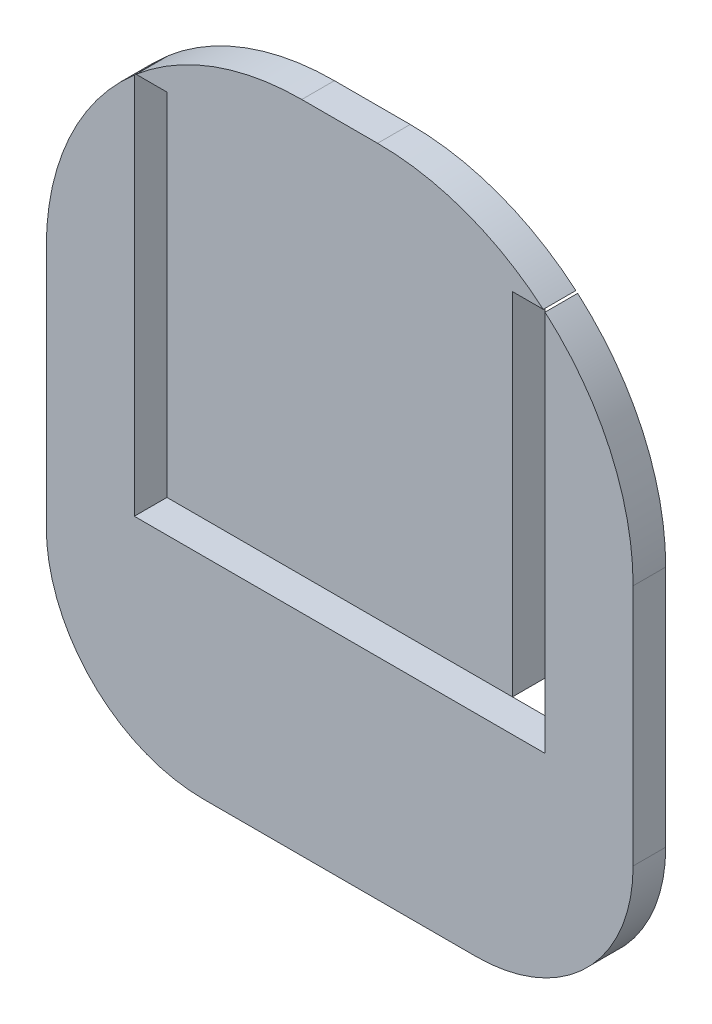
ISO-10303-21;
HEADER;
FILE_DESCRIPTION(('STEP AP214'),'2;1');
FILE_NAME('part.step','',(''),(''),'','','');
FILE_SCHEMA(('AUTOMOTIVE_DESIGN { 1 0 10303 214 1 1 1 1 }'));
ENDSEC;
DATA;
#1=APPLICATION_CONTEXT('core data for automotive mechanical design processes');
#2=APPLICATION_PROTOCOL_DEFINITION('international standard','automotive_design',2000,#1);
#3=PRODUCT_CONTEXT('',#1,'mechanical');
#4=PRODUCT('Part','Part','',(#3));
#5=PRODUCT_RELATED_PRODUCT_CATEGORY('part','',(#4));
#6=PRODUCT_DEFINITION_FORMATION('','',#4);
#7=PRODUCT_DEFINITION_CONTEXT('part definition',#1,'design');
#8=PRODUCT_DEFINITION('design','',#6,#7);
#9=PRODUCT_DEFINITION_SHAPE('','',#8);
#10=(LENGTH_UNIT() NAMED_UNIT(*) SI_UNIT(.MILLI.,.METRE.));
#11=(NAMED_UNIT(*) PLANE_ANGLE_UNIT() SI_UNIT($,.RADIAN.));
#12=(NAMED_UNIT(*) SI_UNIT($,.STERADIAN.) SOLID_ANGLE_UNIT());
#13=UNCERTAINTY_MEASURE_WITH_UNIT(LENGTH_MEASURE(1.E-05),#10,'distance_accuracy_value','');
#14=(GEOMETRIC_REPRESENTATION_CONTEXT(3) GLOBAL_UNCERTAINTY_ASSIGNED_CONTEXT((#13)) GLOBAL_UNIT_ASSIGNED_CONTEXT((#10,
#11,#12)) REPRESENTATION_CONTEXT('',''));
#15=CARTESIAN_POINT('',(0.,0.,0.));
#16=DIRECTION('',(0.,0.,1.));
#17=DIRECTION('',(1.,0.,0.));
#18=AXIS2_PLACEMENT_3D('',#15,#16,#17);
#19=CARTESIAN_POINT('',(5.,-29.5,4.3));
#20=DIRECTION('',(0.,0.,-1.));
#21=DIRECTION('',(-1.,0.,0.));
#22=AXIS2_PLACEMENT_3D('',#19,#20,#21);
#23=CYLINDRICAL_SURFACE('',#22,33.7);
#24=CARTESIAN_POINT('',(5.,-29.5,4.3));
#25=DIRECTION('',(0.,0.,1.));
#26=DIRECTION('',(-1.,0.,0.));
#27=AXIS2_PLACEMENT_3D('',#24,#25,#26);
#28=CIRCLE('',#27,33.7);
#29=CARTESIAN_POINT('',(26.85235312187,-3.84527990725494,4.3));
#30=VERTEX_POINT('',#29);
#31=CARTESIAN_POINT('',(5.,4.2,4.3));
#32=VERTEX_POINT('',#31);
#33=EDGE_CURVE('E142',#30,#32,#28,.T.);
#34=ORIENTED_EDGE('',*,*,#33,.F.);
#35=DIRECTION('',(0.,0.,-1.));
#36=VECTOR('',#35,1.);
#37=CARTESIAN_POINT('',(26.85235312187,-3.84527990725494,4.3));
#38=LINE('',#37,#36);
#39=CARTESIAN_POINT('',(26.85235312187,-3.84527990725494,0.));
#40=VERTEX_POINT('',#39);
#41=EDGE_CURVE('E65',#30,#40,#38,.T.);
#42=ORIENTED_EDGE('',*,*,#41,.T.);
#43=CARTESIAN_POINT('',(5.,-29.5,0.));
#44=DIRECTION('',(0.,0.,1.));
#45=DIRECTION('',(-1.,0.,0.));
#46=AXIS2_PLACEMENT_3D('',#43,#44,#45);
#47=CIRCLE('',#46,33.7);
#48=CARTESIAN_POINT('',(5.,4.2,0.));
#49=VERTEX_POINT('',#48);
#50=EDGE_CURVE('E51',#40,#49,#47,.T.);
#51=ORIENTED_EDGE('',*,*,#50,.T.);
#52=DIRECTION('',(0.,0.,-1.));
#53=VECTOR('',#52,1.);
#54=CARTESIAN_POINT('',(5.,4.2,4.3));
#55=LINE('',#54,#53);
#56=EDGE_CURVE('E146',#32,#49,#55,.T.);
#57=ORIENTED_EDGE('',*,*,#56,.F.);
#58=EDGE_LOOP('',(#34,#42,#51,#57));
#59=FACE_BOUND('',#58,.T.);
#60=ADVANCED_FACE('F48',(#59),#23,.T.);
#61=CARTESIAN_POINT('',(-18.,-61.5,4.3));
#62=DIRECTION('',(0.,0.,1.));
#63=DIRECTION('',(1.,0.,0.));
#64=AXIS2_PLACEMENT_3D('',#61,#62,#63);
#65=PLANE('',#64);
#66=DIRECTION('',(-1.,0.,0.));
#67=VECTOR('',#66,1.);
#68=CARTESIAN_POINT('',(-27.085,-3.84527990725494,4.3));
#69=LINE('',#68,#67);
#70=CARTESIAN_POINT('',(-22.785,-3.84527990725494,4.3));
#71=VERTEX_POINT('',#70);
#72=CARTESIAN_POINT('',(-26.85235312187,-3.84527990725494,4.3));
#73=VERTEX_POINT('',#72);
#74=EDGE_CURVE('E174',#71,#73,#69,.T.);
#75=ORIENTED_EDGE('',*,*,#74,.F.);
#76=DIRECTION('',(0.,1.,0.));
#77=VECTOR('',#76,1.);
#78=CARTESIAN_POINT('',(-22.785,-3.84527990725494,4.3));
#79=LINE('',#78,#77);
#80=CARTESIAN_POINT('',(-22.785,-50.1452799072549,4.3));
#81=VERTEX_POINT('',#80);
#82=EDGE_CURVE('E171',#81,#71,#79,.T.);
#83=ORIENTED_EDGE('',*,*,#82,.F.);
#84=DIRECTION('',(-1.,0.,0.));
#85=VECTOR('',#84,1.);
#86=CARTESIAN_POINT('',(-22.785,-50.1452799072549,4.3));
#87=LINE('',#86,#85);
#88=CARTESIAN_POINT('',(22.785,-50.1452799072549,4.3));
#89=VERTEX_POINT('',#88);
#90=EDGE_CURVE('E126',#89,#81,#87,.T.);
#91=ORIENTED_EDGE('',*,*,#90,.F.);
#92=DIRECTION('',(0.,-1.,0.));
#93=VECTOR('',#92,1.);
#94=CARTESIAN_POINT('',(22.785,-50.1452799072549,4.3));
#95=LINE('',#94,#93);
#96=CARTESIAN_POINT('',(22.785,-3.84527990725494,4.3));
#97=VERTEX_POINT('',#96);
#98=EDGE_CURVE('E57',#97,#89,#95,.T.);
#99=ORIENTED_EDGE('',*,*,#98,.F.);
#100=DIRECTION('',(-1.,0.,0.));
#101=VECTOR('',#100,1.);
#102=CARTESIAN_POINT('',(22.785,-3.84527990725494,4.3));
#103=LINE('',#102,#101);
#104=EDGE_CURVE('E12',#30,#97,#103,.T.);
#105=ORIENTED_EDGE('',*,*,#104,.F.);
#106=ORIENTED_EDGE('',*,*,#33,.T.);
#107=DIRECTION('',(-1.,0.,0.));
#108=VECTOR('',#107,1.);
#109=CARTESIAN_POINT('',(-4.99999999999999,4.2,4.3));
#110=LINE('',#109,#108);
#111=CARTESIAN_POINT('',(-4.99999999999999,4.2,4.3));
#112=VERTEX_POINT('',#111);
#113=EDGE_CURVE('E141',#32,#112,#110,.T.);
#114=ORIENTED_EDGE('',*,*,#113,.T.);
#115=CARTESIAN_POINT('',(-4.99999999999999,-29.5,4.3));
#116=DIRECTION('',(0.,0.,1.));
#117=DIRECTION('',(-1.,0.,0.));
#118=AXIS2_PLACEMENT_3D('',#115,#116,#117);
#119=CIRCLE('',#118,33.7);
#120=EDGE_CURVE('E138',#112,#73,#119,.T.);
#121=ORIENTED_EDGE('',*,*,#120,.T.);
#122=EDGE_LOOP('',(#75,#83,#91,#99,#105,#106,#114,#121));
#123=FACE_BOUND('',#122,.T.);
#124=ADVANCED_FACE('F132',(#123),#65,.T.);
#125=CARTESIAN_POINT('',(-18.,-61.5,0.));
#126=DIRECTION('',(0.,0.,1.));
#127=DIRECTION('',(1.,0.,0.));
#128=AXIS2_PLACEMENT_3D('',#125,#126,#127);
#129=PLANE('',#128);
#130=DIRECTION('',(0.,1.,0.));
#131=VECTOR('',#130,1.);
#132=CARTESIAN_POINT('',(-22.785,-61.5,0.));
#133=LINE('',#132,#131);
#134=CARTESIAN_POINT('',(-22.785,-50.1452799072549,0.));
#135=VERTEX_POINT('',#134);
#136=CARTESIAN_POINT('',(-22.785,-3.84527990725494,0.));
#137=VERTEX_POINT('',#136);
#138=EDGE_CURVE('E94',#135,#137,#133,.T.);
#139=ORIENTED_EDGE('',*,*,#138,.T.);
#140=DIRECTION('',(-1.,0.,0.));
#141=VECTOR('',#140,1.);
#142=CARTESIAN_POINT('',(-18.,-3.84527990725494,0.));
#143=LINE('',#142,#141);
#144=CARTESIAN_POINT('',(-26.85235312187,-3.84527990725494,0.));
#145=VERTEX_POINT('',#144);
#146=EDGE_CURVE('E187',#137,#145,#143,.T.);
#147=ORIENTED_EDGE('',*,*,#146,.T.);
#148=CARTESIAN_POINT('',(-4.99999999999999,-29.5,0.));
#149=DIRECTION('',(0.,0.,1.));
#150=DIRECTION('',(-1.,0.,0.));
#151=AXIS2_PLACEMENT_3D('',#148,#149,#150);
#152=CIRCLE('',#151,33.7);
#153=CARTESIAN_POINT('',(-4.99999999999999,4.2,0.));
#154=VERTEX_POINT('',#153);
#155=EDGE_CURVE('E143',#154,#145,#152,.T.);
#156=ORIENTED_EDGE('',*,*,#155,.F.);
#157=DIRECTION('',(-1.,0.,0.));
#158=VECTOR('',#157,1.);
#159=CARTESIAN_POINT('',(-4.99999999999999,4.2,0.));
#160=LINE('',#159,#158);
#161=EDGE_CURVE('E154',#49,#154,#160,.T.);
#162=ORIENTED_EDGE('',*,*,#161,.F.);
#163=ORIENTED_EDGE('',*,*,#50,.F.);
#164=DIRECTION('',(-1.,0.,0.));
#165=VECTOR('',#164,1.);
#166=CARTESIAN_POINT('',(-18.,-3.84527990725494,0.));
#167=LINE('',#166,#165);
#168=CARTESIAN_POINT('',(22.785,-3.84527990725494,0.));
#169=VERTEX_POINT('',#168);
#170=EDGE_CURVE('E164',#40,#169,#167,.T.);
#171=ORIENTED_EDGE('',*,*,#170,.T.);
#172=DIRECTION('',(0.,-1.,0.));
#173=VECTOR('',#172,1.);
#174=CARTESIAN_POINT('',(22.785,-61.5,0.));
#175=LINE('',#174,#173);
#176=CARTESIAN_POINT('',(22.785,-50.1452799072549,0.));
#177=VERTEX_POINT('',#176);
#178=EDGE_CURVE('E124',#169,#177,#175,.T.);
#179=ORIENTED_EDGE('',*,*,#178,.T.);
#180=DIRECTION('',(-1.,0.,0.));
#181=VECTOR('',#180,1.);
#182=CARTESIAN_POINT('',(-18.,-50.1452799072549,0.));
#183=LINE('',#182,#181);
#184=EDGE_CURVE('E160',#177,#135,#183,.T.);
#185=ORIENTED_EDGE('',*,*,#184,.T.);
#186=EDGE_LOOP('',(#139,#147,#156,#162,#163,#171,#179,#185));
#187=FACE_BOUND('',#186,.T.);
#188=ADVANCED_FACE('F185',(#187),#129,.F.);
#189=CARTESIAN_POINT('',(-4.99999999999999,4.2,4.3));
#190=DIRECTION('',(0.,-1.,0.));
#191=DIRECTION('',(1.,0.,0.));
#192=AXIS2_PLACEMENT_3D('',#189,#190,#191);
#193=PLANE('',#192);
#194=ORIENTED_EDGE('',*,*,#161,.T.);
#195=DIRECTION('',(0.,0.,-1.));
#196=VECTOR('',#195,1.);
#197=CARTESIAN_POINT('',(-4.99999999999999,4.2,4.3));
#198=LINE('',#197,#196);
#199=EDGE_CURVE('E151',#112,#154,#198,.T.);
#200=ORIENTED_EDGE('',*,*,#199,.F.);
#201=ORIENTED_EDGE('',*,*,#113,.F.);
#202=ORIENTED_EDGE('',*,*,#56,.T.);
#203=EDGE_LOOP('',(#194,#200,#201,#202));
#204=FACE_BOUND('',#203,.T.);
#205=ADVANCED_FACE('F193',(#204),#193,.F.);
#206=CARTESIAN_POINT('',(-4.99999999999999,-29.5,4.3));
#207=DIRECTION('',(0.,0.,-1.));
#208=DIRECTION('',(-1.,0.,0.));
#209=AXIS2_PLACEMENT_3D('',#206,#207,#208);
#210=CYLINDRICAL_SURFACE('',#209,33.7);
#211=ORIENTED_EDGE('',*,*,#155,.T.);
#212=DIRECTION('',(0.,0.,-1.));
#213=VECTOR('',#212,1.);
#214=CARTESIAN_POINT('',(-26.85235312187,-3.84527990725494,4.3));
#215=LINE('',#214,#213);
#216=EDGE_CURVE('E145',#145,#73,#215,.F.);
#217=ORIENTED_EDGE('',*,*,#216,.T.);
#218=ORIENTED_EDGE('',*,*,#120,.F.);
#219=ORIENTED_EDGE('',*,*,#199,.T.);
#220=EDGE_LOOP('',(#211,#217,#218,#219));
#221=FACE_BOUND('',#220,.T.);
#222=ADVANCED_FACE('F182',(#221),#210,.T.);
#223=CARTESIAN_POINT('',(-27.085,-3.84527990725494,-5.7));
#224=DIRECTION('',(0.,1.,0.));
#225=DIRECTION('',(0.,0.,1.));
#226=AXIS2_PLACEMENT_3D('',#223,#224,#225);
#227=PLANE('',#226);
#228=ORIENTED_EDGE('',*,*,#146,.F.);
#229=DIRECTION('',(0.,0.,1.));
#230=VECTOR('',#229,1.);
#231=CARTESIAN_POINT('',(-22.785,-3.84527990725494,-5.7));
#232=LINE('',#231,#230);
#233=EDGE_CURVE('E166',#137,#71,#232,.T.);
#234=ORIENTED_EDGE('',*,*,#233,.T.);
#235=ORIENTED_EDGE('',*,*,#74,.T.);
#236=ORIENTED_EDGE('',*,*,#216,.F.);
#237=EDGE_LOOP('',(#228,#234,#235,#236));
#238=FACE_BOUND('',#237,.T.);
#239=ADVANCED_FACE('F180',(#238),#227,.F.);
#240=CARTESIAN_POINT('',(-22.785,-3.84527990725494,-5.7));
#241=DIRECTION('',(1.,0.,0.));
#242=DIRECTION('',(0.,1.,0.));
#243=AXIS2_PLACEMENT_3D('',#240,#241,#242);
#244=PLANE('',#243);
#245=DIRECTION('',(0.,0.,1.));
#246=VECTOR('',#245,1.);
#247=CARTESIAN_POINT('',(-22.785,-50.1452799072549,-5.7));
#248=LINE('',#247,#246);
#249=EDGE_CURVE('E172',#135,#81,#248,.T.);
#250=ORIENTED_EDGE('',*,*,#249,.T.);
#251=ORIENTED_EDGE('',*,*,#82,.T.);
#252=ORIENTED_EDGE('',*,*,#233,.F.);
#253=ORIENTED_EDGE('',*,*,#138,.F.);
#254=EDGE_LOOP('',(#250,#251,#252,#253));
#255=FACE_BOUND('',#254,.T.);
#256=ADVANCED_FACE('F177',(#255),#244,.F.);
#257=CARTESIAN_POINT('',(-22.785,-50.1452799072549,-5.7));
#258=DIRECTION('',(0.,1.,0.));
#259=DIRECTION('',(0.,0.,1.));
#260=AXIS2_PLACEMENT_3D('',#257,#258,#259);
#261=PLANE('',#260);
#262=DIRECTION('',(0.,0.,1.));
#263=VECTOR('',#262,1.);
#264=CARTESIAN_POINT('',(22.785,-50.1452799072549,-5.7));
#265=LINE('',#264,#263);
#266=EDGE_CURVE('E87',#177,#89,#265,.T.);
#267=ORIENTED_EDGE('',*,*,#266,.T.);
#268=ORIENTED_EDGE('',*,*,#90,.T.);
#269=ORIENTED_EDGE('',*,*,#249,.F.);
#270=ORIENTED_EDGE('',*,*,#184,.F.);
#271=EDGE_LOOP('',(#267,#268,#269,#270));
#272=FACE_BOUND('',#271,.T.);
#273=ADVANCED_FACE('F214',(#272),#261,.F.);
#274=CARTESIAN_POINT('',(22.785,-50.1452799072549,-5.7));
#275=DIRECTION('',(-1.,0.,0.));
#276=DIRECTION('',(0.,-1.,0.));
#277=AXIS2_PLACEMENT_3D('',#274,#275,#276);
#278=PLANE('',#277);
#279=DIRECTION('',(0.,0.,1.));
#280=VECTOR('',#279,1.);
#281=CARTESIAN_POINT('',(22.785,-3.84527990725494,-5.7));
#282=LINE('',#281,#280);
#283=EDGE_CURVE('E117',#169,#97,#282,.T.);
#284=ORIENTED_EDGE('',*,*,#283,.T.);
#285=ORIENTED_EDGE('',*,*,#98,.T.);
#286=ORIENTED_EDGE('',*,*,#266,.F.);
#287=ORIENTED_EDGE('',*,*,#178,.F.);
#288=EDGE_LOOP('',(#284,#285,#286,#287));
#289=FACE_BOUND('',#288,.T.);
#290=ADVANCED_FACE('F120',(#289),#278,.F.);
#291=CARTESIAN_POINT('',(22.785,-3.84527990725494,-5.7));
#292=DIRECTION('',(0.,1.,0.));
#293=DIRECTION('',(0.,0.,1.));
#294=AXIS2_PLACEMENT_3D('',#291,#292,#293);
#295=PLANE('',#294);
#296=ORIENTED_EDGE('',*,*,#104,.T.);
#297=ORIENTED_EDGE('',*,*,#283,.F.);
#298=ORIENTED_EDGE('',*,*,#170,.F.);
#299=ORIENTED_EDGE('',*,*,#41,.F.);
#300=EDGE_LOOP('',(#296,#297,#298,#299));
#301=FACE_BOUND('',#300,.T.);
#302=ADVANCED_FACE('F128',(#301),#295,.F.);
#303=CLOSED_SHELL('',(#60,#124,#188,#205,#222,#239,#256,#273,#290,#302));
#304=MANIFOLD_SOLID_BREP('B2',#303);
#305=CARTESIAN_POINT('',(-38.7,-29.5,4.3));
#306=DIRECTION('',(1.,0.,0.));
#307=DIRECTION('',(0.,0.,-1.));
#308=AXIS2_PLACEMENT_3D('',#305,#306,#307);
#309=PLANE('',#308);
#310=DIRECTION('',(0.,-1.,0.));
#311=VECTOR('',#310,1.);
#312=CARTESIAN_POINT('',(-38.7,-29.5,0.));
#313=LINE('',#312,#311);
#314=CARTESIAN_POINT('',(-38.7,-29.5,0.));
#315=VERTEX_POINT('',#314);
#316=CARTESIAN_POINT('',(-38.7,-61.5,0.));
#317=VERTEX_POINT('',#316);
#318=EDGE_CURVE('E327',#315,#317,#313,.T.);
#319=ORIENTED_EDGE('',*,*,#318,.T.);
#320=DIRECTION('',(0.,0.,-1.));
#321=VECTOR('',#320,1.);
#322=CARTESIAN_POINT('',(-38.7,-61.5,4.3));
#323=LINE('',#322,#321);
#324=CARTESIAN_POINT('',(-38.7,-61.5,4.3));
#325=VERTEX_POINT('',#324);
#326=EDGE_CURVE('E386',#325,#317,#323,.T.);
#327=ORIENTED_EDGE('',*,*,#326,.F.);
#328=DIRECTION('',(0.,-1.,0.));
#329=VECTOR('',#328,1.);
#330=CARTESIAN_POINT('',(-38.7,-29.5,4.3));
#331=LINE('',#330,#329);
#332=CARTESIAN_POINT('',(-38.7,-29.5,4.3));
#333=VERTEX_POINT('',#332);
#334=EDGE_CURVE('E300',#333,#325,#331,.T.);
#335=ORIENTED_EDGE('',*,*,#334,.F.);
#336=DIRECTION('',(0.,0.,-1.));
#337=VECTOR('',#336,1.);
#338=CARTESIAN_POINT('',(-38.7,-29.5,4.3));
#339=LINE('',#338,#337);
#340=EDGE_CURVE('E371',#333,#315,#339,.T.);
#341=ORIENTED_EDGE('',*,*,#340,.T.);
#342=EDGE_LOOP('',(#319,#327,#335,#341));
#343=FACE_BOUND('',#342,.T.);
#344=ADVANCED_FACE('F275',(#343),#309,.F.);
#345=CARTESIAN_POINT('',(-18.,-61.5,4.3));
#346=DIRECTION('',(0.,0.,-1.));
#347=DIRECTION('',(-1.,0.,0.));
#348=AXIS2_PLACEMENT_3D('',#345,#346,#347);
#349=CYLINDRICAL_SURFACE('',#348,20.7);
#350=CARTESIAN_POINT('',(-18.,-61.5,0.));
#351=DIRECTION('',(0.,0.,1.));
#352=DIRECTION('',(1.,0.,0.));
#353=AXIS2_PLACEMENT_3D('',#350,#351,#352);
#354=CIRCLE('',#353,20.7);
#355=CARTESIAN_POINT('',(-18.,-82.2,0.));
#356=VERTEX_POINT('',#355);
#357=EDGE_CURVE('E387',#317,#356,#354,.T.);
#358=ORIENTED_EDGE('',*,*,#357,.T.);
#359=DIRECTION('',(0.,0.,-1.));
#360=VECTOR('',#359,1.);
#361=CARTESIAN_POINT('',(-18.,-82.2,4.3));
#362=LINE('',#361,#360);
#363=CARTESIAN_POINT('',(-18.,-82.2,4.3));
#364=VERTEX_POINT('',#363);
#365=EDGE_CURVE('E419',#364,#356,#362,.T.);
#366=ORIENTED_EDGE('',*,*,#365,.F.);
#367=CARTESIAN_POINT('',(-18.,-61.5,4.3));
#368=DIRECTION('',(0.,0.,1.));
#369=DIRECTION('',(1.,0.,0.));
#370=AXIS2_PLACEMENT_3D('',#367,#368,#369);
#371=CIRCLE('',#370,20.7);
#372=EDGE_CURVE('E408',#325,#364,#371,.T.);
#373=ORIENTED_EDGE('',*,*,#372,.F.);
#374=ORIENTED_EDGE('',*,*,#326,.T.);
#375=EDGE_LOOP('',(#358,#366,#373,#374));
#376=FACE_BOUND('',#375,.T.);
#377=ADVANCED_FACE('F277',(#376),#349,.T.);
#378=CARTESIAN_POINT('',(0.500000000000015,-82.2,4.3));
#379=DIRECTION('',(0.,1.,0.));
#380=DIRECTION('',(0.,0.,1.));
#381=AXIS2_PLACEMENT_3D('',#378,#379,#380);
#382=PLANE('',#381);
#383=DIRECTION('',(1.,0.,0.));
#384=VECTOR('',#383,1.);
#385=CARTESIAN_POINT('',(0.500000000000015,-82.2,0.));
#386=LINE('',#385,#384);
#387=CARTESIAN_POINT('',(18.,-82.2,0.));
#388=VERTEX_POINT('',#387);
#389=EDGE_CURVE('E391',#356,#388,#386,.T.);
#390=ORIENTED_EDGE('',*,*,#389,.T.);
#391=DIRECTION('',(0.,0.,-1.));
#392=VECTOR('',#391,1.);
#393=CARTESIAN_POINT('',(18.,-82.2,4.3));
#394=LINE('',#393,#392);
#395=CARTESIAN_POINT('',(18.,-82.2,4.3));
#396=VERTEX_POINT('',#395);
#397=EDGE_CURVE('E415',#396,#388,#394,.T.);
#398=ORIENTED_EDGE('',*,*,#397,.F.);
#399=DIRECTION('',(1.,0.,0.));
#400=VECTOR('',#399,1.);
#401=CARTESIAN_POINT('',(-18.,-82.2,4.3));
#402=LINE('',#401,#400);
#403=EDGE_CURVE('E336',#364,#396,#402,.T.);
#404=ORIENTED_EDGE('',*,*,#403,.F.);
#405=ORIENTED_EDGE('',*,*,#365,.T.);
#406=EDGE_LOOP('',(#390,#398,#404,#405));
#407=FACE_BOUND('',#406,.T.);
#408=ADVANCED_FACE('F454',(#407),#382,.F.);
#409=CARTESIAN_POINT('',(18.,-61.5,4.3));
#410=DIRECTION('',(0.,0.,-1.));
#411=DIRECTION('',(-1.,0.,0.));
#412=AXIS2_PLACEMENT_3D('',#409,#410,#411);
#413=CYLINDRICAL_SURFACE('',#412,20.7);
#414=CARTESIAN_POINT('',(18.,-61.5,0.));
#415=DIRECTION('',(0.,0.,1.));
#416=DIRECTION('',(1.,0.,0.));
#417=AXIS2_PLACEMENT_3D('',#414,#415,#416);
#418=CIRCLE('',#417,20.7);
#419=CARTESIAN_POINT('',(38.7,-61.5,0.));
#420=VERTEX_POINT('',#419);
#421=EDGE_CURVE('E395',#388,#420,#418,.T.);
#422=ORIENTED_EDGE('',*,*,#421,.T.);
#423=DIRECTION('',(0.,0.,-1.));
#424=VECTOR('',#423,1.);
#425=CARTESIAN_POINT('',(38.7,-61.5,4.3));
#426=LINE('',#425,#424);
#427=CARTESIAN_POINT('',(38.7,-61.5,4.3));
#428=VERTEX_POINT('',#427);
#429=EDGE_CURVE('E370',#428,#420,#426,.T.);
#430=ORIENTED_EDGE('',*,*,#429,.F.);
#431=CARTESIAN_POINT('',(18.,-61.5,4.3));
#432=DIRECTION('',(0.,0.,1.));
#433=DIRECTION('',(1.,0.,0.));
#434=AXIS2_PLACEMENT_3D('',#431,#432,#433);
#435=CIRCLE('',#434,20.7);
#436=EDGE_CURVE('E355',#396,#428,#435,.T.);
#437=ORIENTED_EDGE('',*,*,#436,.F.);
#438=ORIENTED_EDGE('',*,*,#397,.T.);
#439=EDGE_LOOP('',(#422,#430,#437,#438));
#440=FACE_BOUND('',#439,.T.);
#441=ADVANCED_FACE('F457',(#440),#413,.T.);
#442=CARTESIAN_POINT('',(38.7,-29.5,4.3));
#443=DIRECTION('',(-1.,0.,0.));
#444=DIRECTION('',(0.,0.,1.));
#445=AXIS2_PLACEMENT_3D('',#442,#443,#444);
#446=PLANE('',#445);
#447=DIRECTION('',(0.,1.,0.));
#448=VECTOR('',#447,1.);
#449=CARTESIAN_POINT('',(38.7,-29.5,0.));
#450=LINE('',#449,#448);
#451=CARTESIAN_POINT('',(38.7,-29.5,0.));
#452=VERTEX_POINT('',#451);
#453=EDGE_CURVE('E365',#420,#452,#450,.T.);
#454=ORIENTED_EDGE('',*,*,#453,.T.);
#455=DIRECTION('',(0.,0.,-1.));
#456=VECTOR('',#455,1.);
#457=CARTESIAN_POINT('',(38.7,-29.5,4.3));
#458=LINE('',#457,#456);
#459=CARTESIAN_POINT('',(38.7,-29.5,4.3));
#460=VERTEX_POINT('',#459);
#461=EDGE_CURVE('E362',#460,#452,#458,.T.);
#462=ORIENTED_EDGE('',*,*,#461,.F.);
#463=DIRECTION('',(0.,1.,0.));
#464=VECTOR('',#463,1.);
#465=CARTESIAN_POINT('',(38.7,-29.5,4.3));
#466=LINE('',#465,#464);
#467=EDGE_CURVE('E346',#428,#460,#466,.T.);
#468=ORIENTED_EDGE('',*,*,#467,.F.);
#469=ORIENTED_EDGE('',*,*,#429,.T.);
#470=EDGE_LOOP('',(#454,#462,#468,#469));
#471=FACE_BOUND('',#470,.T.);
#472=ADVANCED_FACE('F363',(#471),#446,.F.);
#473=CARTESIAN_POINT('',(-18.,-61.5,0.));
#474=DIRECTION('',(0.,0.,1.));
#475=DIRECTION('',(1.,0.,0.));
#476=AXIS2_PLACEMENT_3D('',#473,#474,#475);
#477=PLANE('',#476);
#478=CARTESIAN_POINT('',(-4.99999999999999,-29.5,0.));
#479=DIRECTION('',(0.,0.,1.));
#480=DIRECTION('',(-1.,0.,0.));
#481=AXIS2_PLACEMENT_3D('',#478,#479,#480);
#482=CIRCLE('',#481,33.7);
#483=CARTESIAN_POINT('',(-27.085,-4.04527990725494,0.));
#484=VERTEX_POINT('',#483);
#485=EDGE_CURVE('E403',#484,#315,#482,.T.);
#486=ORIENTED_EDGE('',*,*,#485,.F.);
#487=DIRECTION('',(0.,-1.,0.));
#488=VECTOR('',#487,1.);
#489=CARTESIAN_POINT('',(-27.085,-61.5,0.));
#490=LINE('',#489,#488);
#491=CARTESIAN_POINT('',(-27.085,-54.4452799072549,0.));
#492=VERTEX_POINT('',#491);
#493=EDGE_CURVE('E46',#484,#492,#490,.T.);
#494=ORIENTED_EDGE('',*,*,#493,.T.);
#495=DIRECTION('',(1.,0.,0.));
#496=VECTOR('',#495,1.);
#497=CARTESIAN_POINT('',(-18.,-54.4452799072549,0.));
#498=LINE('',#497,#496);
#499=CARTESIAN_POINT('',(27.085,-54.4452799072549,0.));
#500=VERTEX_POINT('',#499);
#501=EDGE_CURVE('E422',#492,#500,#498,.T.);
#502=ORIENTED_EDGE('',*,*,#501,.T.);
#503=DIRECTION('',(0.,1.,0.));
#504=VECTOR('',#503,1.);
#505=CARTESIAN_POINT('',(27.085,-61.5,0.));
#506=LINE('',#505,#504);
#507=CARTESIAN_POINT('',(27.085,-4.04527990725493,0.));
#508=VERTEX_POINT('',#507);
#509=EDGE_CURVE('E284',#500,#508,#506,.T.);
#510=ORIENTED_EDGE('',*,*,#509,.T.);
#511=CARTESIAN_POINT('',(5.,-29.5,0.));
#512=DIRECTION('',(0.,0.,1.));
#513=DIRECTION('',(-1.,0.,0.));
#514=AXIS2_PLACEMENT_3D('',#511,#512,#513);
#515=CIRCLE('',#514,33.7);
#516=EDGE_CURVE('E400',#452,#508,#515,.T.);
#517=ORIENTED_EDGE('',*,*,#516,.F.);
#518=ORIENTED_EDGE('',*,*,#453,.F.);
#519=ORIENTED_EDGE('',*,*,#421,.F.);
#520=ORIENTED_EDGE('',*,*,#389,.F.);
#521=ORIENTED_EDGE('',*,*,#357,.F.);
#522=ORIENTED_EDGE('',*,*,#318,.F.);
#523=EDGE_LOOP('',(#486,#494,#502,#510,#517,#518,#519,#520,#521,#522));
#524=FACE_BOUND('',#523,.T.);
#525=ADVANCED_FACE('F430',(#524),#477,.F.);
#526=CARTESIAN_POINT('',(-18.,-61.5,4.3));
#527=DIRECTION('',(0.,0.,1.));
#528=DIRECTION('',(1.,0.,0.));
#529=AXIS2_PLACEMENT_3D('',#526,#527,#528);
#530=PLANE('',#529);
#531=DIRECTION('',(0.,-1.,0.));
#532=VECTOR('',#531,1.);
#533=CARTESIAN_POINT('',(-27.085,-4.04527990725494,4.3));
#534=LINE('',#533,#532);
#535=CARTESIAN_POINT('',(-27.085,-4.04527990725494,4.3));
#536=VERTEX_POINT('',#535);
#537=CARTESIAN_POINT('',(-27.085,-54.4452799072549,4.3));
#538=VERTEX_POINT('',#537);
#539=EDGE_CURVE('E472',#536,#538,#534,.T.);
#540=ORIENTED_EDGE('',*,*,#539,.F.);
#541=CARTESIAN_POINT('',(-4.99999999999999,-29.5,4.3));
#542=DIRECTION('',(0.,0.,1.));
#543=DIRECTION('',(-1.,0.,0.));
#544=AXIS2_PLACEMENT_3D('',#541,#542,#543);
#545=CIRCLE('',#544,33.7);
#546=EDGE_CURVE('E378',#536,#333,#545,.T.);
#547=ORIENTED_EDGE('',*,*,#546,.T.);
#548=ORIENTED_EDGE('',*,*,#334,.T.);
#549=ORIENTED_EDGE('',*,*,#372,.T.);
#550=ORIENTED_EDGE('',*,*,#403,.T.);
#551=ORIENTED_EDGE('',*,*,#436,.T.);
#552=ORIENTED_EDGE('',*,*,#467,.T.);
#553=CARTESIAN_POINT('',(5.,-29.5,4.3));
#554=DIRECTION('',(0.,0.,1.));
#555=DIRECTION('',(-1.,0.,0.));
#556=AXIS2_PLACEMENT_3D('',#553,#554,#555);
#557=CIRCLE('',#556,33.7);
#558=CARTESIAN_POINT('',(27.085,-4.04527990725493,4.3));
#559=VERTEX_POINT('',#558);
#560=EDGE_CURVE('E353',#460,#559,#557,.T.);
#561=ORIENTED_EDGE('',*,*,#560,.T.);
#562=DIRECTION('',(0.,1.,0.));
#563=VECTOR('',#562,1.);
#564=CARTESIAN_POINT('',(27.085,-3.84527990725494,4.3));
#565=LINE('',#564,#563);
#566=CARTESIAN_POINT('',(27.085,-54.4452799072549,4.3));
#567=VERTEX_POINT('',#566);
#568=EDGE_CURVE('E437',#567,#559,#565,.T.);
#569=ORIENTED_EDGE('',*,*,#568,.F.);
#570=DIRECTION('',(1.,0.,0.));
#571=VECTOR('',#570,1.);
#572=CARTESIAN_POINT('',(-27.085,-54.4452799072549,4.3));
#573=LINE('',#572,#571);
#574=EDGE_CURVE('E475',#538,#567,#573,.T.);
#575=ORIENTED_EDGE('',*,*,#574,.F.);
#576=EDGE_LOOP('',(#540,#547,#548,#549,#550,#551,#552,#561,#569,#575));
#577=FACE_BOUND('',#576,.T.);
#578=ADVANCED_FACE('F349',(#577),#530,.T.);
#579=CARTESIAN_POINT('',(-4.99999999999999,-29.5,4.3));
#580=DIRECTION('',(0.,0.,-1.));
#581=DIRECTION('',(-1.,0.,0.));
#582=AXIS2_PLACEMENT_3D('',#579,#580,#581);
#583=CYLINDRICAL_SURFACE('',#582,33.7);
#584=ORIENTED_EDGE('',*,*,#546,.F.);
#585=DIRECTION('',(0.,0.,-1.));
#586=VECTOR('',#585,1.);
#587=CARTESIAN_POINT('',(-27.085,-4.04527990725494,4.3));
#588=LINE('',#587,#586);
#589=EDGE_CURVE('E392',#536,#484,#588,.T.);
#590=ORIENTED_EDGE('',*,*,#589,.T.);
#591=ORIENTED_EDGE('',*,*,#485,.T.);
#592=ORIENTED_EDGE('',*,*,#340,.F.);
#593=EDGE_LOOP('',(#584,#590,#591,#592));
#594=FACE_BOUND('',#593,.T.);
#595=ADVANCED_FACE('F465',(#594),#583,.T.);
#596=CARTESIAN_POINT('',(5.,-29.5,4.3));
#597=DIRECTION('',(0.,0.,-1.));
#598=DIRECTION('',(-1.,0.,0.));
#599=AXIS2_PLACEMENT_3D('',#596,#597,#598);
#600=CYLINDRICAL_SURFACE('',#599,33.7);
#601=ORIENTED_EDGE('',*,*,#516,.T.);
#602=DIRECTION('',(0.,0.,-1.));
#603=VECTOR('',#602,1.);
#604=CARTESIAN_POINT('',(27.085,-4.04527990725493,4.3));
#605=LINE('',#604,#603);
#606=EDGE_CURVE('E376',#508,#559,#605,.F.);
#607=ORIENTED_EDGE('',*,*,#606,.T.);
#608=ORIENTED_EDGE('',*,*,#560,.F.);
#609=ORIENTED_EDGE('',*,*,#461,.T.);
#610=EDGE_LOOP('',(#601,#607,#608,#609));
#611=FACE_BOUND('',#610,.T.);
#612=ADVANCED_FACE('F374',(#611),#600,.T.);
#613=CARTESIAN_POINT('',(-27.085,-54.4452799072549,-5.7));
#614=DIRECTION('',(0.,-1.,0.));
#615=DIRECTION('',(0.,0.,-1.));
#616=AXIS2_PLACEMENT_3D('',#613,#614,#615);
#617=PLANE('',#616);
#618=DIRECTION('',(0.,0.,1.));
#619=VECTOR('',#618,1.);
#620=CARTESIAN_POINT('',(-27.085,-54.4452799072549,-5.7));
#621=LINE('',#620,#619);
#622=EDGE_CURVE('E444',#492,#538,#621,.T.);
#623=ORIENTED_EDGE('',*,*,#622,.T.);
#624=ORIENTED_EDGE('',*,*,#574,.T.);
#625=DIRECTION('',(0.,0.,1.));
#626=VECTOR('',#625,1.);
#627=CARTESIAN_POINT('',(27.085,-54.4452799072549,-5.7));
#628=LINE('',#627,#626);
#629=EDGE_CURVE('E291',#500,#567,#628,.T.);
#630=ORIENTED_EDGE('',*,*,#629,.F.);
#631=ORIENTED_EDGE('',*,*,#501,.F.);
#632=EDGE_LOOP('',(#623,#624,#630,#631));
#633=FACE_BOUND('',#632,.T.);
#634=ADVANCED_FACE('F483',(#633),#617,.F.);
#635=CARTESIAN_POINT('',(27.085,-3.84527990725494,-5.7));
#636=DIRECTION('',(1.,0.,0.));
#637=DIRECTION('',(0.,0.,-1.));
#638=AXIS2_PLACEMENT_3D('',#635,#636,#637);
#639=PLANE('',#638);
#640=ORIENTED_EDGE('',*,*,#509,.F.);
#641=ORIENTED_EDGE('',*,*,#629,.T.);
#642=ORIENTED_EDGE('',*,*,#568,.T.);
#643=ORIENTED_EDGE('',*,*,#606,.F.);
#644=EDGE_LOOP('',(#640,#641,#642,#643));
#645=FACE_BOUND('',#644,.T.);
#646=ADVANCED_FACE('F434',(#645),#639,.F.);
#647=CARTESIAN_POINT('',(-27.085,-4.04527990725494,-5.7));
#648=DIRECTION('',(-1.,0.,0.));
#649=DIRECTION('',(0.,0.,1.));
#650=AXIS2_PLACEMENT_3D('',#647,#648,#649);
#651=PLANE('',#650);
#652=ORIENTED_EDGE('',*,*,#539,.T.);
#653=ORIENTED_EDGE('',*,*,#622,.F.);
#654=ORIENTED_EDGE('',*,*,#493,.F.);
#655=ORIENTED_EDGE('',*,*,#589,.F.);
#656=EDGE_LOOP('',(#652,#653,#654,#655));
#657=FACE_BOUND('',#656,.T.);
#658=ADVANCED_FACE('F469',(#657),#651,.F.);
#659=CLOSED_SHELL('',(#344,#377,#408,#441,#472,#525,#578,#595,#612,#634,#646,#658));
#660=MANIFOLD_SOLID_BREP('B6',#659);
#661=ADVANCED_BREP_SHAPE_REPRESENTATION('',(#18,#304,#660),#14);
#662=SHAPE_DEFINITION_REPRESENTATION(#9,#661);
ENDSEC;
END-ISO-10303-21;
